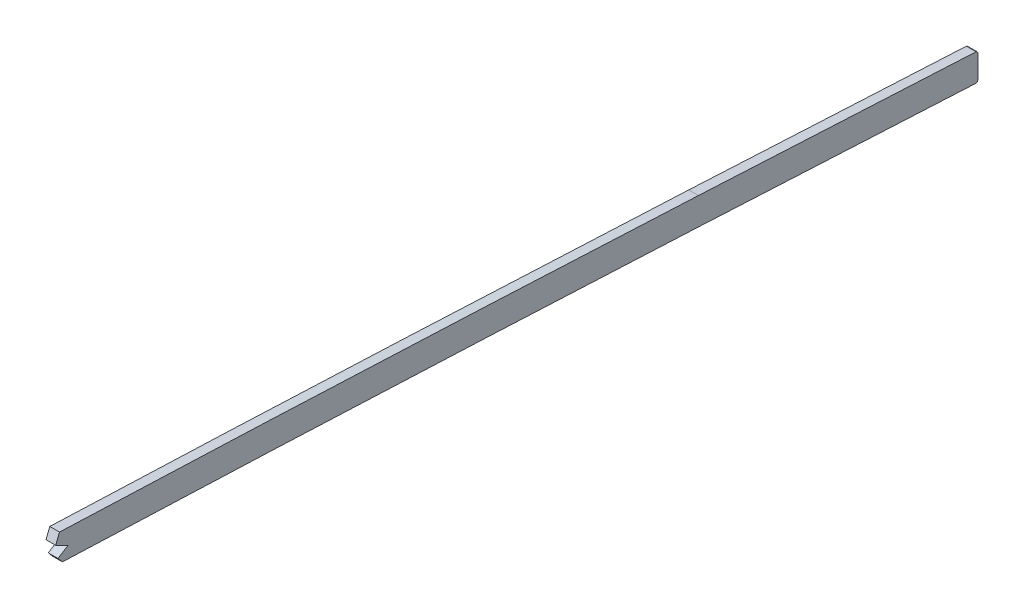
ISO-10303-21;
HEADER;
FILE_DESCRIPTION(('STEP AP214'),'2;1');
FILE_NAME('part.step','',(''),(''),'','','');
FILE_SCHEMA(('AUTOMOTIVE_DESIGN { 1 0 10303 214 1 1 1 1 }'));
ENDSEC;
DATA;
#1=APPLICATION_CONTEXT('core data for automotive mechanical design processes');
#2=APPLICATION_PROTOCOL_DEFINITION('international standard','automotive_design',2000,#1);
#3=PRODUCT_CONTEXT('',#1,'mechanical');
#4=PRODUCT('Part','Part','',(#3));
#5=PRODUCT_RELATED_PRODUCT_CATEGORY('part','',(#4));
#6=PRODUCT_DEFINITION_FORMATION('','',#4);
#7=PRODUCT_DEFINITION_CONTEXT('part definition',#1,'design');
#8=PRODUCT_DEFINITION('design','',#6,#7);
#9=PRODUCT_DEFINITION_SHAPE('','',#8);
#10=(LENGTH_UNIT() NAMED_UNIT(*) SI_UNIT(.MILLI.,.METRE.));
#11=(NAMED_UNIT(*) PLANE_ANGLE_UNIT() SI_UNIT($,.RADIAN.));
#12=(NAMED_UNIT(*) SI_UNIT($,.STERADIAN.) SOLID_ANGLE_UNIT());
#13=UNCERTAINTY_MEASURE_WITH_UNIT(LENGTH_MEASURE(1.E-05),#10,'distance_accuracy_value','');
#14=(GEOMETRIC_REPRESENTATION_CONTEXT(3) GLOBAL_UNCERTAINTY_ASSIGNED_CONTEXT((#13)) GLOBAL_UNIT_ASSIGNED_CONTEXT((#10,
#11,#12)) REPRESENTATION_CONTEXT('',''));
#15=CARTESIAN_POINT('',(0.,0.,0.));
#16=DIRECTION('',(0.,0.,1.));
#17=DIRECTION('',(1.,0.,0.));
#18=AXIS2_PLACEMENT_3D('',#15,#16,#17);
#19=CARTESIAN_POINT('',(-1.5875,130.065080520532,-1227.57650683661));
#20=CARTESIAN_POINT('',(-1.5875,129.853195249361,-1269.91120577335));
#21=CARTESIAN_POINT('',(-1.5875,129.273373321292,-1333.42774670073));
#22=CARTESIAN_POINT('',(-1.5875,127.449050562726,-1418.04220816145));
#23=CARTESIAN_POINT('',(-1.5875,124.913583681604,-1502.66599483243));
#24=CARTESIAN_POINT('',(-1.5875,120.803299478751,-1608.45417698691));
#25=CARTESIAN_POINT('',(-1.5875,116.848243244922,-1693.07007333091));
#26=CARTESIAN_POINT('',(-1.5875,114.744712178998,-1735.36978773271));
#27=B_SPLINE_CURVE_WITH_KNOTS('',3,(#19,#20,#21,#22,#23,#24,#25,#26),.UNSPECIFIED.,.F.,.F.,(4,1,
1,1,1,4),(0.,0.25,0.375,0.5,0.75,1.),.UNSPECIFIED.);
#28=DIRECTION('',(1.,0.,0.));
#29=VECTOR('',#28,1.);
#30=SURFACE_OF_LINEAR_EXTRUSION('',#27,#29);
#31=DIRECTION('',(1.,0.,0.));
#32=VECTOR('',#31,1.);
#33=CARTESIAN_POINT('',(-1.5875,123.861846153961,-1527.87468695882));
#34=LINE('',#33,#32);
#35=CARTESIAN_POINT('',(-1.5875,123.861846153961,-1527.87468695882));
#36=VERTEX_POINT('',#35);
#37=CARTESIAN_POINT('',(1.5875,123.861846153961,-1527.87468695882));
#38=VERTEX_POINT('',#37);
#39=EDGE_CURVE('E58',#36,#38,#34,.T.);
#40=ORIENTED_EDGE('',*,*,#39,.F.);
#41=CARTESIAN_POINT('',(-1.5875,114.744712178998,-1735.36978773271));
#42=VERTEX_POINT('',#41);
#43=EDGE_CURVE('E179',#36,#42,#27,.T.);
#44=ORIENTED_EDGE('',*,*,#43,.T.);
#45=DIRECTION('',(1.,0.,0.));
#46=VECTOR('',#45,1.);
#47=CARTESIAN_POINT('',(-1.5875,114.744712178998,-1735.36978773271));
#48=LINE('',#47,#46);
#49=CARTESIAN_POINT('',(1.5875,114.744712178998,-1735.36978773271));
#50=VERTEX_POINT('',#49);
#51=EDGE_CURVE('E267',#42,#50,#48,.T.);
#52=ORIENTED_EDGE('',*,*,#51,.T.);
#53=CARTESIAN_POINT('',(1.5875,130.065080520532,-1227.57650683661));
#54=CARTESIAN_POINT('',(1.5875,129.853195249361,-1269.91120577335));
#55=CARTESIAN_POINT('',(1.5875,129.273373321292,-1333.42774670073));
#56=CARTESIAN_POINT('',(1.5875,127.449050562726,-1418.04220816145));
#57=CARTESIAN_POINT('',(1.5875,124.913583681604,-1502.66599483243));
#58=CARTESIAN_POINT('',(1.5875,120.803299478751,-1608.45417698691));
#59=CARTESIAN_POINT('',(1.5875,116.848243244922,-1693.07007333091));
#60=CARTESIAN_POINT('',(1.5875,114.744712178998,-1735.36978773271));
#61=B_SPLINE_CURVE_WITH_KNOTS('',3,(#53,#54,#55,#56,#57,#58,#59,#60),.UNSPECIFIED.,.F.,.F.,(4,1,
1,1,1,4),(0.,0.25,0.375,0.5,0.75,1.),.UNSPECIFIED.);
#62=EDGE_CURVE('E189',#38,#50,#61,.T.);
#63=ORIENTED_EDGE('',*,*,#62,.F.);
#64=EDGE_LOOP('',(#40,#44,#52,#63));
#65=FACE_BOUND('',#64,.T.);
#66=ADVANCED_FACE('F40',(#65),#30,.T.);
#67=CARTESIAN_POINT('',(-1.5875,138.954969175154,-1227.62100075096));
#68=CARTESIAN_POINT('',(-1.5875,138.848931677458,-1248.80730367889));
#69=CARTESIAN_POINT('',(-1.5875,138.701170252211,-1269.99358315547));
#70=CARTESIAN_POINT('',(-1.5875,138.270664618355,-1312.36383234785));
#71=CARTESIAN_POINT('',(-1.5875,137.987407831877,-1333.54771900803));
#72=CARTESIAN_POINT('',(-1.5875,137.249274812871,-1375.91236818886));
#73=CARTESIAN_POINT('',(-1.5875,136.792567699979,-1397.09309738037));
#74=CARTESIAN_POINT('',(-1.5875,135.701855834805,-1439.4513282587));
#75=CARTESIAN_POINT('',(-1.5875,135.069210583559,-1460.62901031184));
#76=CARTESIAN_POINT('',(-1.5875,133.670541384634,-1502.97910116089));
#77=CARTESIAN_POINT('',(-1.5875,132.907434339273,-1524.1521527359));
#78=CARTESIAN_POINT('',(-1.5875,131.284732459282,-1566.49430375863));
#79=CARTESIAN_POINT('',(-1.5875,130.423163385131,-1587.66316602409));
#80=CARTESIAN_POINT('',(-1.5875,127.709123982652,-1651.16405280942));
#81=CARTESIAN_POINT('',(-1.5875,125.728325331464,-1693.49042156091));
#82=CARTESIAN_POINT('',(-1.5875,123.62374006878,-1735.81133470922));
#83=B_SPLINE_CURVE_WITH_KNOTS('',3,(#67,#68,#69,#70,#71,#72,#73,#74,#75,#76,#77,#78,#79,#80,#81,
#82),.UNSPECIFIED.,.F.,.F.,(4,2,2,2,2,2,2,4),(0.,0.125,0.25,0.375,0.500000000000001,
0.625000000000001,0.750000000000001,1.),.UNSPECIFIED.);
#84=DIRECTION('',(1.,0.,0.));
#85=VECTOR('',#84,1.);
#86=SURFACE_OF_LINEAR_EXTRUSION('',#83,#85);
#87=CARTESIAN_POINT('',(-1.5875,123.62374006878,-1735.81133470922));
#88=CARTESIAN_POINT('',(-1.5875,125.728325331464,-1693.49042156091));
#89=CARTESIAN_POINT('',(-1.5875,127.709123982652,-1651.16405280942));
#90=CARTESIAN_POINT('',(-1.5875,130.423163385131,-1587.66316602409));
#91=CARTESIAN_POINT('',(-1.5875,131.284732459282,-1566.49430375863));
#92=CARTESIAN_POINT('',(-1.5875,132.331156770195,-1539.18931523739));
#93=CARTESIAN_POINT('',(-1.5875,132.562180358205,-1533.05523634893));
#94=CARTESIAN_POINT('',(-1.5875,132.788776491109,-1526.92099114932));
#95=B_SPLINE_CURVE_WITH_KNOTS('',3,(#87,#88,#89,#90,#91,#92,#93,#94),.UNSPECIFIED.,.F.,.F.,(4,2,
2,4),(0.588783647844293,0.838783647844292,0.963783647844292,1.),.UNSPECIFIED.);
#96=CARTESIAN_POINT('',(-1.5875,132.788739575143,-1526.92098978566));
#97=VERTEX_POINT('',#96);
#98=CARTESIAN_POINT('',(-1.5875,123.62374006878,-1735.81133470922));
#99=VERTEX_POINT('',#98);
#100=EDGE_CURVE('E236',#97,#99,#95,.F.);
#101=ORIENTED_EDGE('',*,*,#100,.F.);
#102=DIRECTION('',(1.,0.,0.));
#103=VECTOR('',#102,1.);
#104=CARTESIAN_POINT('',(-6.0325,132.788776066568,-1526.92100264218));
#105=LINE('',#104,#103);
#106=CARTESIAN_POINT('',(1.5875,132.788739799749,-1526.92098986479));
#107=VERTEX_POINT('',#106);
#108=EDGE_CURVE('E158',#97,#107,#105,.T.);
#109=ORIENTED_EDGE('',*,*,#108,.T.);
#110=CARTESIAN_POINT('',(1.5875,132.788776488503,-1526.92099121988));
#111=CARTESIAN_POINT('',(1.5875,132.562180356433,-1533.05523639597));
#112=CARTESIAN_POINT('',(1.5875,132.331156769294,-1539.18931526091));
#113=CARTESIAN_POINT('',(1.5875,131.284732459282,-1566.49430375863));
#114=CARTESIAN_POINT('',(1.5875,130.423163385131,-1587.66316602409));
#115=CARTESIAN_POINT('',(1.5875,127.709123982652,-1651.16405280942));
#116=CARTESIAN_POINT('',(1.5875,125.728325331464,-1693.49042156091));
#117=CARTESIAN_POINT('',(1.5875,123.62374006878,-1735.81133470922));
#118=B_SPLINE_CURVE_WITH_KNOTS('',3,(#110,#111,#112,#113,#114,#115,#116,#117),.UNSPECIFIED.,.F.,
.F.,(4,2,2,4),(0.588783647983153,0.625000000000001,0.750000000000001,1.),.UNSPECIFIED.);
#119=CARTESIAN_POINT('',(1.5875,123.62374006878,-1735.81133470922));
#120=VERTEX_POINT('',#119);
#121=EDGE_CURVE('E280',#107,#120,#118,.T.);
#122=ORIENTED_EDGE('',*,*,#121,.T.);
#123=DIRECTION('',(1.,0.,0.));
#124=VECTOR('',#123,1.);
#125=CARTESIAN_POINT('',(-1.5875,123.62374006878,-1735.81133470922));
#126=LINE('',#125,#124);
#127=EDGE_CURVE('E207',#99,#120,#126,.T.);
#128=ORIENTED_EDGE('',*,*,#127,.F.);
#129=EDGE_LOOP('',(#101,#109,#122,#128));
#130=FACE_BOUND('',#129,.T.);
#131=ADVANCED_FACE('F257',(#130),#86,.F.);
#132=CARTESIAN_POINT('',(-1.5875,0.,0.));
#133=DIRECTION('',(1.,0.,0.));
#134=DIRECTION('',(0.,0.,-1.));
#135=AXIS2_PLACEMENT_3D('',#132,#133,#134);
#136=PLANE('',#135);
#137=DIRECTION('',(0.,0.458923809256453,0.888475625606886));
#138=VECTOR('',#137,1.);
#139=CARTESIAN_POINT('',(-1.5875,724.419258768723,-374.183867459269));
#140=LINE('',#139,#138);
#141=CARTESIAN_POINT('',(-1.5875,127.575945218119,-1529.67139218656));
#142=VERTEX_POINT('',#141);
#143=CARTESIAN_POINT('',(-1.5875,129.632745347889,-1525.68943103051));
#144=VERTEX_POINT('',#143);
#145=EDGE_CURVE('E164',#142,#144,#140,.T.);
#146=ORIENTED_EDGE('',*,*,#145,.T.);
#147=DIRECTION('',(0.,0.931582630936131,-0.363529643547972));
#148=VECTOR('',#147,1.);
#149=CARTESIAN_POINT('',(-1.5875,-499.555321322261,-1280.1626189093));
#150=LINE('',#149,#148);
#151=EDGE_CURVE('E166',#144,#97,#150,.T.);
#152=ORIENTED_EDGE('',*,*,#151,.T.);
#153=ORIENTED_EDGE('',*,*,#100,.T.);
#154=CARTESIAN_POINT('',(-1.5875,118.934494682825,-1826.49127442047));
#155=CARTESIAN_POINT('',(-1.5875,120.554075468676,-1796.26760813328));
#156=CARTESIAN_POINT('',(-1.5875,122.120437728958,-1766.04106015217));
#157=CARTESIAN_POINT('',(-1.5875,123.62374006878,-1735.81133470922));
#158=B_SPLINE_CURVE_WITH_KNOTS('',3,(#154,#155,#156,#157),.UNSPECIFIED.,.F.,.F.,(4,4),(0.,
0.0937011802525092),.UNSPECIFIED.);
#159=CARTESIAN_POINT('',(-1.5875,118.93446521286,-1826.49127284128));
#160=VERTEX_POINT('',#159);
#161=EDGE_CURVE('E224',#99,#160,#158,.F.);
#162=ORIENTED_EDGE('',*,*,#161,.T.);
#163=CARTESIAN_POINT('',(-1.5875,118.173586379128,-1826.4505));
#164=DIRECTION('',(1.,0.,0.));
#165=DIRECTION('',(0.,0.,-1.));
#166=AXIS2_PLACEMENT_3D('',#163,#164,#165);
#167=CIRCLE('',#166,0.762);
#168=CARTESIAN_POINT('',(-1.5875,118.173586379128,-1827.2125));
#169=VERTEX_POINT('',#168);
#170=EDGE_CURVE('E195',#160,#169,#167,.F.);
#171=ORIENTED_EDGE('',*,*,#170,.T.);
#172=DIRECTION('',(0.,-1.,0.));
#173=VECTOR('',#172,1.);
#174=CARTESIAN_POINT('',(-1.5875,4.56101225421245E-11,-1827.2125));
#175=LINE('',#174,#173);
#176=CARTESIAN_POINT('',(-1.5875,110.804265683327,-1827.2125));
#177=VERTEX_POINT('',#176);
#178=EDGE_CURVE('E170',#169,#177,#175,.T.);
#179=ORIENTED_EDGE('',*,*,#178,.T.);
#180=CARTESIAN_POINT('',(-1.5875,110.804265683327,-1826.4505));
#181=DIRECTION('',(1.,0.,0.));
#182=DIRECTION('',(0.,0.,-1.));
#183=AXIS2_PLACEMENT_3D('',#180,#181,#182);
#184=CIRCLE('',#183,0.762);
#185=CARTESIAN_POINT('',(-1.5875,110.043354463469,-1826.40978003566));
#186=VERTEX_POINT('',#185);
#187=EDGE_CURVE('E192',#177,#186,#184,.F.);
#188=ORIENTED_EDGE('',*,*,#187,.T.);
#189=CARTESIAN_POINT('',(-1.5875,114.744712211049,-1735.36978708818));
#190=CARTESIAN_POINT('',(-1.5875,110.735232017816,-1815.99594072318));
#191=CARTESIAN_POINT('',(-1.5875,104.09636454831,-1936.9066504622));
#192=CARTESIAN_POINT('',(-1.5875,94.1879787504419,-2098.04948516813));
#193=CARTESIAN_POINT('',(-1.5875,87.3146385091305,-2198.69473672509));
#194=CARTESIAN_POINT('',(-1.5875,81.1144189306114,-2279.13041374665));
#195=CARTESIAN_POINT('',(-1.5875,76.0340766078011,-2339.41295030379));
#196=CARTESIAN_POINT('',(-1.5875,70.2827054495217,-2399.56405433432));
#197=CARTESIAN_POINT('',(-1.5875,61.1273782537238,-2479.57046826411));
#198=CARTESIAN_POINT('',(-1.5875,49.6509076137669,-2559.29208787163));
#199=CARTESIAN_POINT('',(-1.5875,38.2354847347183,-2626.79755458493));
#200=CARTESIAN_POINT('',(-1.5875,32.3571302958871,-2659.27265183733));
#201=CARTESIAN_POINT('',(-1.5875,28.6522110138429,-2679.06248770776));
#202=CARTESIAN_POINT('',(-1.5875,26.3541994456866,-2690.94044026322));
#203=CARTESIAN_POINT('',(-1.5875,24.9439248982718,-2698.06642332353));
#204=B_SPLINE_CURVE_WITH_KNOTS('',3,(#189,#190,#191,#192,#193,#194,#195,#196,#197,#198,#199,
#200,#201,#202,#203),.UNSPECIFIED.,.F.,.F.,(4,1,1,1,1,1,1,1,1,1,1,1,4),(0.,0.25,0.375,0.5,
0.5625,0.625,0.6875,0.75,0.875,0.9375,0.962410670199827,0.977446402119896,1.),.UNSPECIFIED.);
#205=EDGE_CURVE('E239',#42,#186,#204,.T.);
#206=ORIENTED_EDGE('',*,*,#205,.F.);
#207=ORIENTED_EDGE('',*,*,#43,.F.);
#208=DIRECTION('',(0.,0.762131167011493,0.647422647325301));
#209=VECTOR('',#208,1.);
#210=CARTESIAN_POINT('',(-1.5875,805.802868351719,-948.572749154283));
#211=LINE('',#210,#209);
#212=CARTESIAN_POINT('',(-1.5875,125.564439067124,-1526.42835165741));
#213=VERTEX_POINT('',#212);
#214=EDGE_CURVE('E163',#36,#213,#211,.T.);
#215=ORIENTED_EDGE('',*,*,#214,.T.);
#216=DIRECTION('',(0.,0.52709506372406,-0.84980632722858));
#217=VECTOR('',#216,1.);
#218=CARTESIAN_POINT('',(-1.5875,-593.052127406611,-367.842458771192));
#219=LINE('',#218,#217);
#220=EDGE_CURVE('E135',#213,#142,#219,.T.);
#221=ORIENTED_EDGE('',*,*,#220,.T.);
#222=EDGE_LOOP('',(#146,#152,#153,#162,#171,#179,#188,#206,#207,#215,#221));
#223=FACE_BOUND('',#222,.T.);
#224=ADVANCED_FACE('F234',(#223),#136,.F.);
#225=CARTESIAN_POINT('',(1.5875,0.,0.));
#226=DIRECTION('',(1.,0.,0.));
#227=DIRECTION('',(0.,0.,-1.));
#228=AXIS2_PLACEMENT_3D('',#225,#226,#227);
#229=PLANE('',#228);
#230=DIRECTION('',(0.,0.931582630936132,-0.363529643547972));
#231=VECTOR('',#230,1.);
#232=CARTESIAN_POINT('',(1.5875,132.788776066568,-1526.92100264218));
#233=LINE('',#232,#231);
#234=CARTESIAN_POINT('',(1.5875,129.632745347889,-1525.68943103051));
#235=VERTEX_POINT('',#234);
#236=EDGE_CURVE('E139',#235,#107,#233,.T.);
#237=ORIENTED_EDGE('',*,*,#236,.F.);
#238=DIRECTION('',(0.,0.458923809256453,0.888475625606886));
#239=VECTOR('',#238,1.);
#240=CARTESIAN_POINT('',(1.5875,129.632745347889,-1525.68943103051));
#241=LINE('',#240,#239);
#242=CARTESIAN_POINT('',(1.5875,127.575945218119,-1529.67139218656));
#243=VERTEX_POINT('',#242);
#244=EDGE_CURVE('E147',#243,#235,#241,.T.);
#245=ORIENTED_EDGE('',*,*,#244,.F.);
#246=DIRECTION('',(0.,0.52709506372406,-0.84980632722858));
#247=VECTOR('',#246,1.);
#248=CARTESIAN_POINT('',(1.5875,127.575945218119,-1529.67139218656));
#249=LINE('',#248,#247);
#250=CARTESIAN_POINT('',(1.5875,125.564439067124,-1526.42835165741));
#251=VERTEX_POINT('',#250);
#252=EDGE_CURVE('E132',#251,#243,#249,.T.);
#253=ORIENTED_EDGE('',*,*,#252,.F.);
#254=DIRECTION('',(0.,0.762131167011493,0.647422647325301));
#255=VECTOR('',#254,1.);
#256=CARTESIAN_POINT('',(1.5875,805.802868351719,-948.572749154283));
#257=LINE('',#256,#255);
#258=EDGE_CURVE('E11',#38,#251,#257,.T.);
#259=ORIENTED_EDGE('',*,*,#258,.F.);
#260=ORIENTED_EDGE('',*,*,#62,.T.);
#261=CARTESIAN_POINT('',(1.5875,114.744712211049,-1735.36978708818));
#262=CARTESIAN_POINT('',(1.5875,110.735232017816,-1815.99594072318));
#263=CARTESIAN_POINT('',(1.5875,104.09636454831,-1936.9066504622));
#264=CARTESIAN_POINT('',(1.5875,94.1879787504419,-2098.04948516813));
#265=CARTESIAN_POINT('',(1.5875,87.3146385091305,-2198.69473672509));
#266=CARTESIAN_POINT('',(1.5875,81.1144189306114,-2279.13041374665));
#267=CARTESIAN_POINT('',(1.5875,76.0340766078011,-2339.41295030379));
#268=CARTESIAN_POINT('',(1.5875,70.2827054495217,-2399.56405433432));
#269=CARTESIAN_POINT('',(1.5875,61.1273782537238,-2479.57046826411));
#270=CARTESIAN_POINT('',(1.5875,49.6509076137669,-2559.29208787163));
#271=CARTESIAN_POINT('',(1.5875,38.2354847347183,-2626.79755458493));
#272=CARTESIAN_POINT('',(1.5875,32.3571302958871,-2659.27265183733));
#273=CARTESIAN_POINT('',(1.5875,28.6522110138429,-2679.06248770776));
#274=CARTESIAN_POINT('',(1.5875,26.3541994456866,-2690.94044026322));
#275=CARTESIAN_POINT('',(1.5875,24.9439248982718,-2698.06642332353));
#276=B_SPLINE_CURVE_WITH_KNOTS('',3,(#261,#262,#263,#264,#265,#266,#267,#268,#269,#270,#271,
#272,#273,#274,#275),.UNSPECIFIED.,.F.,.F.,(4,1,1,1,1,1,1,1,1,1,1,1,4),(0.,0.25,0.375,0.5,
0.5625,0.625,0.6875,0.75,0.875,0.9375,0.962410670199827,0.977446402119896,1.),.UNSPECIFIED.);
#277=CARTESIAN_POINT('',(1.5875,110.043354463469,-1826.40978003566));
#278=VERTEX_POINT('',#277);
#279=EDGE_CURVE('E314',#50,#278,#276,.T.);
#280=ORIENTED_EDGE('',*,*,#279,.T.);
#281=CARTESIAN_POINT('',(1.5875,110.804265683327,-1826.4505));
#282=DIRECTION('',(1.,0.,0.));
#283=DIRECTION('',(0.,0.,-1.));
#284=AXIS2_PLACEMENT_3D('',#281,#282,#283);
#285=CIRCLE('',#284,0.762);
#286=CARTESIAN_POINT('',(1.5875,110.804265683327,-1827.2125));
#287=VERTEX_POINT('',#286);
#288=EDGE_CURVE('E358',#278,#287,#285,.T.);
#289=ORIENTED_EDGE('',*,*,#288,.T.);
#290=DIRECTION('',(0.,-1.,0.));
#291=VECTOR('',#290,1.);
#292=CARTESIAN_POINT('',(1.5875,4.56101225421245E-11,-1827.2125));
#293=LINE('',#292,#291);
#294=CARTESIAN_POINT('',(1.5875,118.173586379128,-1827.2125));
#295=VERTEX_POINT('',#294);
#296=EDGE_CURVE('E202',#295,#287,#293,.T.);
#297=ORIENTED_EDGE('',*,*,#296,.F.);
#298=CARTESIAN_POINT('',(1.5875,118.173586379128,-1826.4505));
#299=DIRECTION('',(1.,0.,0.));
#300=DIRECTION('',(0.,0.,-1.));
#301=AXIS2_PLACEMENT_3D('',#298,#299,#300);
#302=CIRCLE('',#301,0.762);
#303=CARTESIAN_POINT('',(1.5875,118.934465545859,-1826.49127285912));
#304=VERTEX_POINT('',#303);
#305=EDGE_CURVE('E354',#295,#304,#302,.T.);
#306=ORIENTED_EDGE('',*,*,#305,.T.);
#307=CARTESIAN_POINT('',(1.5875,123.62374006878,-1735.81133470922));
#308=CARTESIAN_POINT('',(1.5875,122.120437728959,-1766.04106015213));
#309=CARTESIAN_POINT('',(1.5875,120.554075468679,-1796.26760813321));
#310=CARTESIAN_POINT('',(1.5875,118.93449468283,-1826.49127442037));
#311=B_SPLINE_CURVE_WITH_KNOTS('',3,(#307,#308,#309,#310),.UNSPECIFIED.,.F.,.F.,(4,4),(0.,
0.0937011802524087),.UNSPECIFIED.);
#312=EDGE_CURVE('E227',#120,#304,#311,.T.);
#313=ORIENTED_EDGE('',*,*,#312,.F.);
#314=ORIENTED_EDGE('',*,*,#121,.F.);
#315=EDGE_LOOP('',(#237,#245,#253,#259,#260,#280,#289,#297,#306,#313,#314));
#316=FACE_BOUND('',#315,.T.);
#317=ADVANCED_FACE('F145',(#316),#229,.T.);
#318=DIRECTION('',(1.,0.,0.));
#319=VECTOR('',#318,1.);
#320=SURFACE_OF_LINEAR_EXTRUSION('',#204,#319);
#321=ORIENTED_EDGE('',*,*,#205,.T.);
#322=DIRECTION('',(1.,0.,0.));
#323=VECTOR('',#322,1.);
#324=CARTESIAN_POINT('',(-1.5875,110.043354463469,-1826.40978003566));
#325=LINE('',#324,#323);
#326=EDGE_CURVE('E51',#186,#278,#325,.T.);
#327=ORIENTED_EDGE('',*,*,#326,.T.);
#328=ORIENTED_EDGE('',*,*,#279,.F.);
#329=ORIENTED_EDGE('',*,*,#51,.F.);
#330=EDGE_LOOP('',(#321,#327,#328,#329));
#331=FACE_BOUND('',#330,.T.);
#332=ADVANCED_FACE('F340',(#331),#320,.T.);
#333=CARTESIAN_POINT('',(-1.5875,123.62374006878,-1735.81133470922));
#334=CARTESIAN_POINT('',(-1.5875,121.618292624347,-1776.13863549866));
#335=CARTESIAN_POINT('',(-1.5875,119.500621805793,-1816.46028157928));
#336=CARTESIAN_POINT('',(-1.5875,115.087561884835,-1897.09366867468));
#337=CARTESIAN_POINT('',(-1.5875,112.792971084113,-1937.4056388964));
#338=CARTESIAN_POINT('',(-1.5875,108.01836652323,-2018.0184190449));
#339=CARTESIAN_POINT('',(-1.5875,105.539122976217,-2058.31951222306));
#340=CARTESIAN_POINT('',(-1.5875,100.307240032155,-2138.90378014414));
#341=CARTESIAN_POINT('',(-1.5875,97.5551279550714,-2179.18739792965));
#342=CARTESIAN_POINT('',(-1.5875,93.0801686873999,-2239.58699871448));
#343=CARTESIAN_POINT('',(-1.5875,91.5298376215323,-2259.71628097743));
#344=CARTESIAN_POINT('',(-1.5875,89.0908434299724,-2289.90044260235));
#345=CARTESIAN_POINT('',(-1.5875,88.2588450388707,-2299.96017913521));
#346=CARTESIAN_POINT('',(-1.5875,86.5528616543479,-2320.0760045662));
#347=CARTESIAN_POINT('',(-1.5875,85.6789622226699,-2330.13210089761));
#348=CARTESIAN_POINT('',(-1.5875,83.8743348466212,-2350.23935651754));
#349=CARTESIAN_POINT('',(-1.5875,82.9433074844211,-2360.29048979378));
#350=CARTESIAN_POINT('',(-1.5875,81.0031832968026,-2380.3859739712));
#351=CARTESIAN_POINT('',(-1.5875,79.9934185550902,-2390.43006537759));
#352=CARTESIAN_POINT('',(-1.5875,76.8275775323524,-2420.5470261948));
#353=CARTESIAN_POINT('',(-1.5875,74.5336729547823,-2440.6064858901));
#354=CARTESIAN_POINT('',(-1.5875,69.5562785225382,-2480.67556956821));
#355=CARTESIAN_POINT('',(-1.5875,66.8741508113434,-2500.6871518296));
#356=CARTESIAN_POINT('',(-1.5875,61.1502462952664,-2540.65429020717));
#357=CARTESIAN_POINT('',(-1.5875,58.1097556460363,-2560.61102642776));
#358=CARTESIAN_POINT('',(-1.5875,51.7024655740435,-2600.47545713133));
#359=CARTESIAN_POINT('',(-1.5875,48.3375388880153,-2620.38296708947));
#360=CARTESIAN_POINT('',(-1.5875,43.0416957000558,-2650.1996164959));
#361=CARTESIAN_POINT('',(-1.5875,41.2345222277721,-2660.13118962649));
#362=CARTESIAN_POINT('',(-1.5875,37.5258634945269,-2679.97612471736));
#363=CARTESIAN_POINT('',(-1.5875,35.6245635215631,-2689.88973979233));
#364=CARTESIAN_POINT('',(-1.5875,33.6647813022258,-2699.79233281757));
#365=B_SPLINE_CURVE_WITH_KNOTS('',3,(#333,#334,#335,#336,#337,#338,#339,#340,#341,#342,#343,
#344,#345,#346,#347,#348,#349,#350,#351,#352,#353,#354,#355,#356,#357,#358,#359,#360,#361,#362,
#363,#364),.UNSPECIFIED.,.F.,.F.,(4,2,2,2,2,2,2,2,2,2,2,2,2,2,2,4),(0.,0.125,0.25,0.375,0.5,
0.5625,0.59375,0.625,0.65625,0.6875,0.75,0.8125,0.875,0.9375,0.96875,1.),.UNSPECIFIED.);
#366=DIRECTION('',(1.,0.,0.));
#367=VECTOR('',#366,1.);
#368=SURFACE_OF_LINEAR_EXTRUSION('',#365,#367);
#369=ORIENTED_EDGE('',*,*,#312,.T.);
#370=DIRECTION('',(1.,0.,0.));
#371=VECTOR('',#370,1.);
#372=CARTESIAN_POINT('',(1.5875,118.934494682841,-1826.49127442018));
#373=LINE('',#372,#371);
#374=EDGE_CURVE('E196',#304,#160,#373,.F.);
#375=ORIENTED_EDGE('',*,*,#374,.T.);
#376=ORIENTED_EDGE('',*,*,#161,.F.);
#377=ORIENTED_EDGE('',*,*,#127,.T.);
#378=EDGE_LOOP('',(#369,#375,#376,#377));
#379=FACE_BOUND('',#378,.T.);
#380=ADVANCED_FACE('F222',(#379),#368,.F.);
#381=CARTESIAN_POINT('',(-1.59250269714593,4.56101225421245E-11,-1827.2125));
#382=DIRECTION('',(0.,0.,1.));
#383=DIRECTION('',(0.,-1.,0.));
#384=AXIS2_PLACEMENT_3D('',#381,#382,#383);
#385=PLANE('',#384);
#386=ORIENTED_EDGE('',*,*,#178,.F.);
#387=DIRECTION('',(1.,0.,0.));
#388=VECTOR('',#387,1.);
#389=CARTESIAN_POINT('',(-1.59250269714593,118.173586379128,-1827.2125));
#390=LINE('',#389,#388);
#391=EDGE_CURVE('E355',#169,#295,#390,.T.);
#392=ORIENTED_EDGE('',*,*,#391,.T.);
#393=ORIENTED_EDGE('',*,*,#296,.T.);
#394=DIRECTION('',(-1.,0.,0.));
#395=VECTOR('',#394,1.);
#396=CARTESIAN_POINT('',(-1.5875,110.804265683327,-1827.2125));
#397=LINE('',#396,#395);
#398=EDGE_CURVE('E199',#287,#177,#397,.T.);
#399=ORIENTED_EDGE('',*,*,#398,.T.);
#400=EDGE_LOOP('',(#386,#392,#393,#399));
#401=FACE_BOUND('',#400,.T.);
#402=ADVANCED_FACE('F258',(#401),#385,.F.);
#403=CARTESIAN_POINT('',(0.,118.173586379128,-1826.4505));
#404=DIRECTION('',(1.,0.,0.));
#405=DIRECTION('',(0.,0.,-1.));
#406=AXIS2_PLACEMENT_3D('',#403,#404,#405);
#407=CYLINDRICAL_SURFACE('',#406,0.762);
#408=ORIENTED_EDGE('',*,*,#305,.F.);
#409=ORIENTED_EDGE('',*,*,#391,.F.);
#410=ORIENTED_EDGE('',*,*,#170,.F.);
#411=ORIENTED_EDGE('',*,*,#374,.F.);
#412=EDGE_LOOP('',(#408,#409,#410,#411));
#413=FACE_BOUND('',#412,.T.);
#414=ADVANCED_FACE('F344',(#413),#407,.T.);
#415=CARTESIAN_POINT('',(0.,110.804265683327,-1826.4505));
#416=DIRECTION('',(1.,0.,0.));
#417=DIRECTION('',(0.,0.,-1.));
#418=AXIS2_PLACEMENT_3D('',#415,#416,#417);
#419=CYLINDRICAL_SURFACE('',#418,0.762);
#420=ORIENTED_EDGE('',*,*,#288,.F.);
#421=ORIENTED_EDGE('',*,*,#326,.F.);
#422=ORIENTED_EDGE('',*,*,#187,.F.);
#423=ORIENTED_EDGE('',*,*,#398,.F.);
#424=EDGE_LOOP('',(#420,#421,#422,#423));
#425=FACE_BOUND('',#424,.T.);
#426=ADVANCED_FACE('F42',(#425),#419,.T.);
#427=CARTESIAN_POINT('',(-6.0325,132.788776066568,-1526.92100264218));
#428=DIRECTION('',(0.,-0.363529643547972,-0.931582630936131));
#429=DIRECTION('',(0.,0.931582630936131,-0.363529643547972));
#430=AXIS2_PLACEMENT_3D('',#427,#428,#429);
#431=PLANE('',#430);
#432=DIRECTION('',(1.,0.,0.));
#433=VECTOR('',#432,1.);
#434=CARTESIAN_POINT('',(-6.0325,129.632745347889,-1525.68943103051));
#435=LINE('',#434,#433);
#436=EDGE_CURVE('E155',#144,#235,#435,.T.);
#437=ORIENTED_EDGE('',*,*,#436,.T.);
#438=ORIENTED_EDGE('',*,*,#236,.T.);
#439=ORIENTED_EDGE('',*,*,#108,.F.);
#440=ORIENTED_EDGE('',*,*,#151,.F.);
#441=EDGE_LOOP('',(#437,#438,#439,#440));
#442=FACE_BOUND('',#441,.T.);
#443=ADVANCED_FACE('F350',(#442),#431,.F.);
#444=CARTESIAN_POINT('',(-6.0325,129.632745347889,-1525.68943103051));
#445=DIRECTION('',(0.,0.888475625606886,-0.458923809256453));
#446=DIRECTION('',(0.,0.458923809256453,0.888475625606886));
#447=AXIS2_PLACEMENT_3D('',#444,#445,#446);
#448=PLANE('',#447);
#449=DIRECTION('',(1.,0.,0.));
#450=VECTOR('',#449,1.);
#451=CARTESIAN_POINT('',(-6.0325,127.575945218119,-1529.67139218656));
#452=LINE('',#451,#450);
#453=EDGE_CURVE('E138',#142,#243,#452,.T.);
#454=ORIENTED_EDGE('',*,*,#453,.T.);
#455=ORIENTED_EDGE('',*,*,#244,.T.);
#456=ORIENTED_EDGE('',*,*,#436,.F.);
#457=ORIENTED_EDGE('',*,*,#145,.F.);
#458=EDGE_LOOP('',(#454,#455,#456,#457));
#459=FACE_BOUND('',#458,.T.);
#460=ADVANCED_FACE('F376',(#459),#448,.F.);
#461=CARTESIAN_POINT('',(-6.0325,127.575945218119,-1529.67139218656));
#462=DIRECTION('',(0.,-0.84980632722858,-0.52709506372406));
#463=DIRECTION('',(0.,0.52709506372406,-0.84980632722858));
#464=AXIS2_PLACEMENT_3D('',#461,#462,#463);
#465=PLANE('',#464);
#466=DIRECTION('',(1.,0.,0.));
#467=VECTOR('',#466,1.);
#468=CARTESIAN_POINT('',(-6.0325,125.564439067124,-1526.42835165741));
#469=LINE('',#468,#467);
#470=EDGE_CURVE('E128',#213,#251,#469,.T.);
#471=ORIENTED_EDGE('',*,*,#470,.T.);
#472=ORIENTED_EDGE('',*,*,#252,.T.);
#473=ORIENTED_EDGE('',*,*,#453,.F.);
#474=ORIENTED_EDGE('',*,*,#220,.F.);
#475=EDGE_LOOP('',(#471,#472,#473,#474));
#476=FACE_BOUND('',#475,.T.);
#477=ADVANCED_FACE('F129',(#476),#465,.F.);
#478=CARTESIAN_POINT('',(-6.0325,125.564439067124,-1526.42835165741));
#479=DIRECTION('',(0.,0.6474226473253,-0.762131167011493));
#480=DIRECTION('',(0.,0.762131167011493,0.647422647325301));
#481=AXIS2_PLACEMENT_3D('',#478,#479,#480);
#482=PLANE('',#481);
#483=ORIENTED_EDGE('',*,*,#39,.T.);
#484=ORIENTED_EDGE('',*,*,#258,.T.);
#485=ORIENTED_EDGE('',*,*,#470,.F.);
#486=ORIENTED_EDGE('',*,*,#214,.F.);
#487=EDGE_LOOP('',(#483,#484,#485,#486));
#488=FACE_BOUND('',#487,.T.);
#489=ADVANCED_FACE('F141',(#488),#482,.F.);
#490=CLOSED_SHELL('',(#66,#131,#224,#317,#332,#380,#402,#414,#426,#443,#460,#477,#489));
#491=MANIFOLD_SOLID_BREP('B2',#490);
#492=ADVANCED_BREP_SHAPE_REPRESENTATION('',(#18,#491),#14);
#493=SHAPE_DEFINITION_REPRESENTATION(#9,#492);
ENDSEC;
END-ISO-10303-21;
